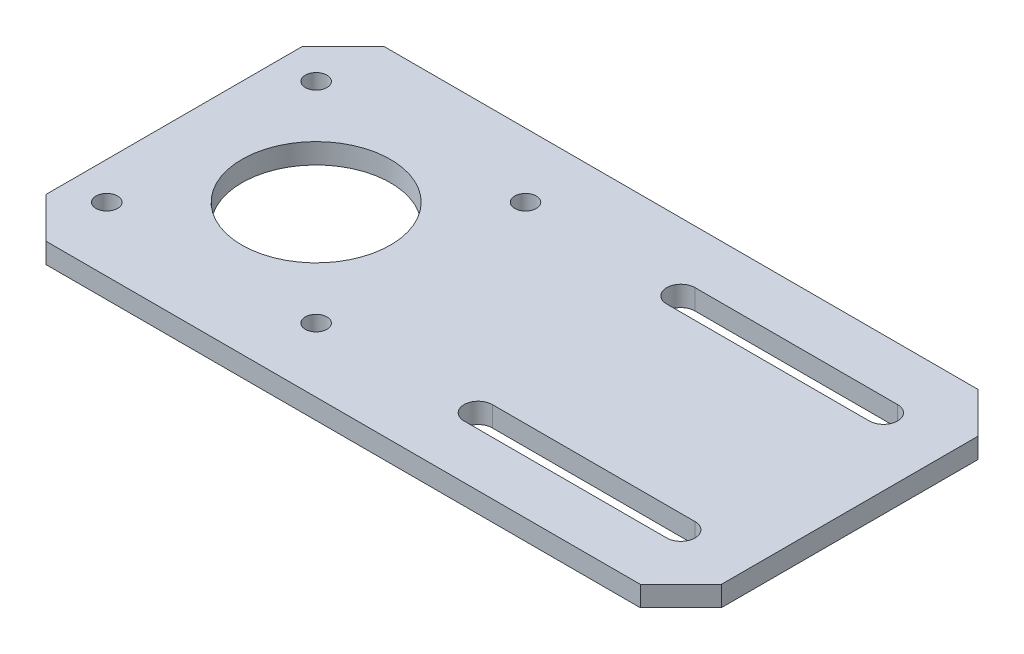
ISO-10303-21;
HEADER;
FILE_DESCRIPTION(('STEP AP214'),'2;1');
FILE_NAME('part.step','',(''),(''),'','','');
FILE_SCHEMA(('AUTOMOTIVE_DESIGN { 1 0 10303 214 1 1 1 1 }'));
ENDSEC;
DATA;
#1=APPLICATION_CONTEXT('core data for automotive mechanical design processes');
#2=APPLICATION_PROTOCOL_DEFINITION('international standard','automotive_design',2000,#1);
#3=PRODUCT_CONTEXT('',#1,'mechanical');
#4=PRODUCT('Part','Part','',(#3));
#5=PRODUCT_RELATED_PRODUCT_CATEGORY('part','',(#4));
#6=PRODUCT_DEFINITION_FORMATION('','',#4);
#7=PRODUCT_DEFINITION_CONTEXT('part definition',#1,'design');
#8=PRODUCT_DEFINITION('design','',#6,#7);
#9=PRODUCT_DEFINITION_SHAPE('','',#8);
#10=(LENGTH_UNIT() NAMED_UNIT(*) SI_UNIT(.MILLI.,.METRE.));
#11=(NAMED_UNIT(*) PLANE_ANGLE_UNIT() SI_UNIT($,.RADIAN.));
#12=(NAMED_UNIT(*) SI_UNIT($,.STERADIAN.) SOLID_ANGLE_UNIT());
#13=UNCERTAINTY_MEASURE_WITH_UNIT(LENGTH_MEASURE(1.E-05),#10,'distance_accuracy_value','');
#14=(GEOMETRIC_REPRESENTATION_CONTEXT(3) GLOBAL_UNCERTAINTY_ASSIGNED_CONTEXT((#13)) GLOBAL_UNIT_ASSIGNED_CONTEXT((#10,
#11,#12)) REPRESENTATION_CONTEXT('',''));
#15=CARTESIAN_POINT('',(0.,0.,0.));
#16=DIRECTION('',(0.,0.,1.));
#17=DIRECTION('',(1.,0.,0.));
#18=AXIS2_PLACEMENT_3D('',#15,#16,#17);
#19=CARTESIAN_POINT('',(0.,3.,0.));
#20=DIRECTION('',(0.,-1.,0.));
#21=DIRECTION('',(0.,0.,-1.));
#22=AXIS2_PLACEMENT_3D('',#19,#20,#21);
#23=PLANE('',#22);
#24=CARTESIAN_POINT('',(60.,3.,-40.));
#25=DIRECTION('',(0.,1.,0.));
#26=DIRECTION('',(0.,0.,1.));
#27=AXIS2_PLACEMENT_3D('',#24,#25,#26);
#28=CIRCLE('',#27,2.09999999999999);
#29=CARTESIAN_POINT('',(60.,3.,-42.1));
#30=VERTEX_POINT('',#29);
#31=CARTESIAN_POINT('',(60.,3.,-37.9));
#32=VERTEX_POINT('',#31);
#33=EDGE_CURVE('E192',#30,#32,#28,.T.);
#34=ORIENTED_EDGE('',*,*,#33,.F.);
#35=DIRECTION('',(-1.,0.,0.));
#36=VECTOR('',#35,1.);
#37=CARTESIAN_POINT('',(60.,3.,-42.1));
#38=LINE('',#37,#36);
#39=CARTESIAN_POINT('',(90.,3.,-42.1));
#40=VERTEX_POINT('',#39);
#41=EDGE_CURVE('E200',#40,#30,#38,.T.);
#42=ORIENTED_EDGE('',*,*,#41,.F.);
#43=CARTESIAN_POINT('',(90.,3.,-40.));
#44=DIRECTION('',(0.,1.,0.));
#45=DIRECTION('',(0.,0.,1.));
#46=AXIS2_PLACEMENT_3D('',#43,#44,#45);
#47=CIRCLE('',#46,2.09999999999999);
#48=CARTESIAN_POINT('',(90.,3.,-37.9));
#49=VERTEX_POINT('',#48);
#50=EDGE_CURVE('E197',#49,#40,#47,.T.);
#51=ORIENTED_EDGE('',*,*,#50,.F.);
#52=DIRECTION('',(1.,0.,0.));
#53=VECTOR('',#52,1.);
#54=CARTESIAN_POINT('',(60.,3.,-37.9));
#55=LINE('',#54,#53);
#56=EDGE_CURVE('E194',#32,#49,#55,.T.);
#57=ORIENTED_EDGE('',*,*,#56,.F.);
#58=EDGE_LOOP('',(#34,#42,#51,#57));
#59=FACE_BOUND('',#58,.T.);
#60=DIRECTION('',(0.,0.,1.));
#61=VECTOR('',#60,1.);
#62=CARTESIAN_POINT('',(0.,3.,0.));
#63=LINE('',#62,#61);
#64=CARTESIAN_POINT('',(0.,3.,-44.));
#65=VERTEX_POINT('',#64);
#66=CARTESIAN_POINT('',(0.,3.,-6.00000000000003));
#67=VERTEX_POINT('',#66);
#68=EDGE_CURVE('E253',#65,#67,#63,.T.);
#69=ORIENTED_EDGE('',*,*,#68,.T.);
#70=DIRECTION('',(-0.707106781186547,0.,-0.707106781186548));
#71=VECTOR('',#70,1.);
#72=CARTESIAN_POINT('',(6.00000000000002,3.,0.));
#73=LINE('',#72,#71);
#74=CARTESIAN_POINT('',(6.00000000000002,3.,0.));
#75=VERTEX_POINT('',#74);
#76=EDGE_CURVE('E296',#67,#75,#73,.F.);
#77=ORIENTED_EDGE('',*,*,#76,.T.);
#78=DIRECTION('',(1.,0.,0.));
#79=VECTOR('',#78,1.);
#80=CARTESIAN_POINT('',(0.,3.,0.));
#81=LINE('',#80,#79);
#82=CARTESIAN_POINT('',(94.,3.,0.));
#83=VERTEX_POINT('',#82);
#84=EDGE_CURVE('E256',#75,#83,#81,.T.);
#85=ORIENTED_EDGE('',*,*,#84,.T.);
#86=DIRECTION('',(-0.707106781186548,0.,0.707106781186547));
#87=VECTOR('',#86,1.);
#88=CARTESIAN_POINT('',(100.,3.,-6.00000000000002));
#89=LINE('',#88,#87);
#90=CARTESIAN_POINT('',(100.,3.,-6.00000000000002));
#91=VERTEX_POINT('',#90);
#92=EDGE_CURVE('E291',#83,#91,#89,.F.);
#93=ORIENTED_EDGE('',*,*,#92,.T.);
#94=DIRECTION('',(0.,0.,-1.));
#95=VECTOR('',#94,1.);
#96=CARTESIAN_POINT('',(100.,3.,0.));
#97=LINE('',#96,#95);
#98=CARTESIAN_POINT('',(100.,3.,-44.));
#99=VERTEX_POINT('',#98);
#100=EDGE_CURVE('E260',#91,#99,#97,.T.);
#101=ORIENTED_EDGE('',*,*,#100,.T.);
#102=DIRECTION('',(0.707106781186545,0.,0.70710678118655));
#103=VECTOR('',#102,1.);
#104=CARTESIAN_POINT('',(94.,3.,-50.));
#105=LINE('',#104,#103);
#106=CARTESIAN_POINT('',(94.,3.,-50.));
#107=VERTEX_POINT('',#106);
#108=EDGE_CURVE('E58',#99,#107,#105,.F.);
#109=ORIENTED_EDGE('',*,*,#108,.T.);
#110=DIRECTION('',(-1.,0.,0.));
#111=VECTOR('',#110,1.);
#112=CARTESIAN_POINT('',(0.,3.,-50.));
#113=LINE('',#112,#111);
#114=CARTESIAN_POINT('',(6.00000000000003,3.,-50.));
#115=VERTEX_POINT('',#114);
#116=EDGE_CURVE('E262',#107,#115,#113,.T.);
#117=ORIENTED_EDGE('',*,*,#116,.T.);
#118=DIRECTION('',(0.707106781186549,0.,-0.707106781186546));
#119=VECTOR('',#118,1.);
#120=CARTESIAN_POINT('',(0.,3.,-44.));
#121=LINE('',#120,#119);
#122=EDGE_CURVE('E294',#115,#65,#121,.F.);
#123=ORIENTED_EDGE('',*,*,#122,.T.);
#124=EDGE_LOOP('',(#69,#77,#85,#93,#101,#109,#117,#123));
#125=FACE_BOUND('',#124,.T.);
#126=CARTESIAN_POINT('',(21.,3.,-25.));
#127=DIRECTION('',(0.,1.,0.));
#128=DIRECTION('',(0.,0.,1.));
#129=AXIS2_PLACEMENT_3D('',#126,#127,#128);
#130=CIRCLE('',#129,11.);
#131=CARTESIAN_POINT('',(21.,3.,-14.));
#132=VERTEX_POINT('',#131);
#133=EDGE_CURVE('E247',#132,#132,#130,.T.);
#134=ORIENTED_EDGE('',*,*,#133,.F.);
#135=EDGE_LOOP('',(#134));
#136=FACE_BOUND('',#135,.T.);
#137=CARTESIAN_POINT('',(5.5,3.,-40.5));
#138=DIRECTION('',(0.,1.,0.));
#139=DIRECTION('',(0.,0.,1.));
#140=AXIS2_PLACEMENT_3D('',#137,#138,#139);
#141=CIRCLE('',#140,1.6);
#142=CARTESIAN_POINT('',(5.5,3.,-38.9));
#143=VERTEX_POINT('',#142);
#144=EDGE_CURVE('E241',#143,#143,#141,.T.);
#145=ORIENTED_EDGE('',*,*,#144,.F.);
#146=EDGE_LOOP('',(#145));
#147=FACE_BOUND('',#146,.T.);
#148=CARTESIAN_POINT('',(36.5,3.,-40.5));
#149=DIRECTION('',(0.,1.,0.));
#150=DIRECTION('',(0.,0.,1.));
#151=AXIS2_PLACEMENT_3D('',#148,#149,#150);
#152=CIRCLE('',#151,1.6);
#153=CARTESIAN_POINT('',(36.5,3.,-38.9));
#154=VERTEX_POINT('',#153);
#155=EDGE_CURVE('E235',#154,#154,#152,.T.);
#156=ORIENTED_EDGE('',*,*,#155,.F.);
#157=EDGE_LOOP('',(#156));
#158=FACE_BOUND('',#157,.T.);
#159=CARTESIAN_POINT('',(36.5,3.,-9.5));
#160=DIRECTION('',(0.,1.,0.));
#161=DIRECTION('',(0.,0.,1.));
#162=AXIS2_PLACEMENT_3D('',#159,#160,#161);
#163=CIRCLE('',#162,1.6);
#164=CARTESIAN_POINT('',(36.5,3.,-7.9));
#165=VERTEX_POINT('',#164);
#166=EDGE_CURVE('E229',#165,#165,#163,.T.);
#167=ORIENTED_EDGE('',*,*,#166,.F.);
#168=EDGE_LOOP('',(#167));
#169=FACE_BOUND('',#168,.T.);
#170=CARTESIAN_POINT('',(5.50000000000001,3.,-9.5));
#171=DIRECTION('',(0.,1.,0.));
#172=DIRECTION('',(0.,0.,1.));
#173=AXIS2_PLACEMENT_3D('',#170,#171,#172);
#174=CIRCLE('',#173,1.6);
#175=CARTESIAN_POINT('',(5.50000000000001,3.,-7.9));
#176=VERTEX_POINT('',#175);
#177=EDGE_CURVE('E223',#176,#176,#174,.T.);
#178=ORIENTED_EDGE('',*,*,#177,.F.);
#179=EDGE_LOOP('',(#178));
#180=FACE_BOUND('',#179,.T.);
#181=CARTESIAN_POINT('',(60.,3.,-10.));
#182=DIRECTION('',(0.,1.,0.));
#183=DIRECTION('',(0.,0.,-1.));
#184=AXIS2_PLACEMENT_3D('',#181,#182,#183);
#185=CIRCLE('',#184,2.09999999999999);
#186=CARTESIAN_POINT('',(60.,3.,-12.1));
#187=VERTEX_POINT('',#186);
#188=CARTESIAN_POINT('',(60.,3.,-7.90000000000001));
#189=VERTEX_POINT('',#188);
#190=EDGE_CURVE('E151',#187,#189,#185,.T.);
#191=ORIENTED_EDGE('',*,*,#190,.F.);
#192=DIRECTION('',(-1.,0.,0.));
#193=VECTOR('',#192,1.);
#194=CARTESIAN_POINT('',(60.,3.,-12.1));
#195=LINE('',#194,#193);
#196=CARTESIAN_POINT('',(90.,3.,-12.1));
#197=VERTEX_POINT('',#196);
#198=EDGE_CURVE('E176',#197,#187,#195,.T.);
#199=ORIENTED_EDGE('',*,*,#198,.F.);
#200=CARTESIAN_POINT('',(90.,3.,-10.));
#201=DIRECTION('',(0.,1.,0.));
#202=DIRECTION('',(0.,0.,-1.));
#203=AXIS2_PLACEMENT_3D('',#200,#201,#202);
#204=CIRCLE('',#203,2.09999999999999);
#205=CARTESIAN_POINT('',(90.,3.,-7.90000000000002));
#206=VERTEX_POINT('',#205);
#207=EDGE_CURVE('E174',#206,#197,#204,.T.);
#208=ORIENTED_EDGE('',*,*,#207,.F.);
#209=DIRECTION('',(1.,0.,0.));
#210=VECTOR('',#209,1.);
#211=CARTESIAN_POINT('',(60.,3.,-7.90000000000001));
#212=LINE('',#211,#210);
#213=EDGE_CURVE('E161',#189,#206,#212,.T.);
#214=ORIENTED_EDGE('',*,*,#213,.F.);
#215=EDGE_LOOP('',(#191,#199,#208,#214));
#216=FACE_BOUND('',#215,.T.);
#217=ADVANCED_FACE('F36',(#59,#125,#136,#147,#158,#169,#180,#216),#23,.F.);
#218=CARTESIAN_POINT('',(0.,0.,0.));
#219=DIRECTION('',(0.,-1.,0.));
#220=DIRECTION('',(0.,0.,-1.));
#221=AXIS2_PLACEMENT_3D('',#218,#219,#220);
#222=PLANE('',#221);
#223=CARTESIAN_POINT('',(36.5,0.,-9.5));
#224=DIRECTION('',(0.,1.,0.));
#225=DIRECTION('',(0.,0.,1.));
#226=AXIS2_PLACEMENT_3D('',#223,#224,#225);
#227=CIRCLE('',#226,1.6);
#228=CARTESIAN_POINT('',(36.5,0.,-7.9));
#229=VERTEX_POINT('',#228);
#230=EDGE_CURVE('E226',#229,#229,#227,.T.);
#231=ORIENTED_EDGE('',*,*,#230,.T.);
#232=EDGE_LOOP('',(#231));
#233=FACE_BOUND('',#232,.T.);
#234=CARTESIAN_POINT('',(5.5,0.,-40.5));
#235=DIRECTION('',(0.,1.,0.));
#236=DIRECTION('',(0.,0.,1.));
#237=AXIS2_PLACEMENT_3D('',#234,#235,#236);
#238=CIRCLE('',#237,1.6);
#239=CARTESIAN_POINT('',(5.5,0.,-38.9));
#240=VERTEX_POINT('',#239);
#241=EDGE_CURVE('E238',#240,#240,#238,.T.);
#242=ORIENTED_EDGE('',*,*,#241,.T.);
#243=EDGE_LOOP('',(#242));
#244=FACE_BOUND('',#243,.T.);
#245=DIRECTION('',(1.,0.,0.));
#246=VECTOR('',#245,1.);
#247=CARTESIAN_POINT('',(0.,0.,0.));
#248=LINE('',#247,#246);
#249=CARTESIAN_POINT('',(6.00000000000002,0.,0.));
#250=VERTEX_POINT('',#249);
#251=CARTESIAN_POINT('',(94.,0.,0.));
#252=VERTEX_POINT('',#251);
#253=EDGE_CURVE('E267',#250,#252,#248,.T.);
#254=ORIENTED_EDGE('',*,*,#253,.F.);
#255=DIRECTION('',(0.707106781186547,0.,0.707106781186548));
#256=VECTOR('',#255,1.);
#257=CARTESIAN_POINT('',(3.00000000000002,0.,-3.00000000000001));
#258=LINE('',#257,#256);
#259=CARTESIAN_POINT('',(0.,0.,-6.00000000000003));
#260=VERTEX_POINT('',#259);
#261=EDGE_CURVE('E284',#250,#260,#258,.F.);
#262=ORIENTED_EDGE('',*,*,#261,.T.);
#263=DIRECTION('',(0.,0.,1.));
#264=VECTOR('',#263,1.);
#265=CARTESIAN_POINT('',(0.,0.,0.));
#266=LINE('',#265,#264);
#267=CARTESIAN_POINT('',(0.,0.,-44.));
#268=VERTEX_POINT('',#267);
#269=EDGE_CURVE('E250',#268,#260,#266,.T.);
#270=ORIENTED_EDGE('',*,*,#269,.F.);
#271=DIRECTION('',(-0.707106781186549,0.,0.707106781186546));
#272=VECTOR('',#271,1.);
#273=CARTESIAN_POINT('',(-22.,0.,-22.0000000000001));
#274=LINE('',#273,#272);
#275=CARTESIAN_POINT('',(6.00000000000003,0.,-50.));
#276=VERTEX_POINT('',#275);
#277=EDGE_CURVE('E282',#268,#276,#274,.F.);
#278=ORIENTED_EDGE('',*,*,#277,.T.);
#279=DIRECTION('',(-1.,0.,0.));
#280=VECTOR('',#279,1.);
#281=CARTESIAN_POINT('',(0.,0.,-50.));
#282=LINE('',#281,#280);
#283=CARTESIAN_POINT('',(94.,0.,-50.));
#284=VERTEX_POINT('',#283);
#285=EDGE_CURVE('E257',#284,#276,#282,.T.);
#286=ORIENTED_EDGE('',*,*,#285,.F.);
#287=DIRECTION('',(-0.707106781186545,0.,-0.70710678118655));
#288=VECTOR('',#287,1.);
#289=CARTESIAN_POINT('',(72.0000000000003,0.,-71.9999999999998));
#290=LINE('',#289,#288);
#291=CARTESIAN_POINT('',(100.,0.,-44.));
#292=VERTEX_POINT('',#291);
#293=EDGE_CURVE('E280',#284,#292,#290,.F.);
#294=ORIENTED_EDGE('',*,*,#293,.T.);
#295=DIRECTION('',(0.,0.,-1.));
#296=VECTOR('',#295,1.);
#297=CARTESIAN_POINT('',(100.,0.,0.));
#298=LINE('',#297,#296);
#299=CARTESIAN_POINT('',(100.,0.,-6.00000000000002));
#300=VERTEX_POINT('',#299);
#301=EDGE_CURVE('E270',#300,#292,#298,.T.);
#302=ORIENTED_EDGE('',*,*,#301,.F.);
#303=DIRECTION('',(0.707106781186548,0.,-0.707106781186547));
#304=VECTOR('',#303,1.);
#305=CARTESIAN_POINT('',(46.9999999999999,0.,47.));
#306=LINE('',#305,#304);
#307=EDGE_CURVE('E278',#300,#252,#306,.F.);
#308=ORIENTED_EDGE('',*,*,#307,.T.);
#309=EDGE_LOOP('',(#254,#262,#270,#278,#286,#294,#302,#308));
#310=FACE_BOUND('',#309,.T.);
#311=CARTESIAN_POINT('',(21.,0.,-25.));
#312=DIRECTION('',(0.,1.,0.));
#313=DIRECTION('',(0.,0.,1.));
#314=AXIS2_PLACEMENT_3D('',#311,#312,#313);
#315=CIRCLE('',#314,11.);
#316=CARTESIAN_POINT('',(21.,0.,-14.));
#317=VERTEX_POINT('',#316);
#318=EDGE_CURVE('E244',#317,#317,#315,.T.);
#319=ORIENTED_EDGE('',*,*,#318,.T.);
#320=EDGE_LOOP('',(#319));
#321=FACE_BOUND('',#320,.T.);
#322=CARTESIAN_POINT('',(36.5,0.,-40.5));
#323=DIRECTION('',(0.,1.,0.));
#324=DIRECTION('',(0.,0.,1.));
#325=AXIS2_PLACEMENT_3D('',#322,#323,#324);
#326=CIRCLE('',#325,1.6);
#327=CARTESIAN_POINT('',(36.5,0.,-38.9));
#328=VERTEX_POINT('',#327);
#329=EDGE_CURVE('E232',#328,#328,#326,.T.);
#330=ORIENTED_EDGE('',*,*,#329,.T.);
#331=EDGE_LOOP('',(#330));
#332=FACE_BOUND('',#331,.T.);
#333=CARTESIAN_POINT('',(5.50000000000001,0.,-9.5));
#334=DIRECTION('',(0.,1.,0.));
#335=DIRECTION('',(0.,0.,1.));
#336=AXIS2_PLACEMENT_3D('',#333,#334,#335);
#337=CIRCLE('',#336,1.6);
#338=CARTESIAN_POINT('',(5.50000000000001,0.,-7.9));
#339=VERTEX_POINT('',#338);
#340=EDGE_CURVE('E222',#339,#339,#337,.T.);
#341=ORIENTED_EDGE('',*,*,#340,.T.);
#342=EDGE_LOOP('',(#341));
#343=FACE_BOUND('',#342,.T.);
#344=DIRECTION('',(-1.,0.,0.));
#345=VECTOR('',#344,1.);
#346=CARTESIAN_POINT('',(60.,0.,-42.1));
#347=LINE('',#346,#345);
#348=CARTESIAN_POINT('',(90.,0.,-42.1));
#349=VERTEX_POINT('',#348);
#350=CARTESIAN_POINT('',(60.,0.,-42.1));
#351=VERTEX_POINT('',#350);
#352=EDGE_CURVE('E195',#349,#351,#347,.T.);
#353=ORIENTED_EDGE('',*,*,#352,.T.);
#354=CARTESIAN_POINT('',(60.,0.,-40.));
#355=DIRECTION('',(0.,1.,0.));
#356=DIRECTION('',(0.,0.,1.));
#357=AXIS2_PLACEMENT_3D('',#354,#355,#356);
#358=CIRCLE('',#357,2.09999999999999);
#359=CARTESIAN_POINT('',(60.,0.,-37.9));
#360=VERTEX_POINT('',#359);
#361=EDGE_CURVE('E169',#351,#360,#358,.T.);
#362=ORIENTED_EDGE('',*,*,#361,.T.);
#363=DIRECTION('',(1.,0.,0.));
#364=VECTOR('',#363,1.);
#365=CARTESIAN_POINT('',(60.,0.,-37.9));
#366=LINE('',#365,#364);
#367=CARTESIAN_POINT('',(90.,0.,-37.9));
#368=VERTEX_POINT('',#367);
#369=EDGE_CURVE('E205',#360,#368,#366,.T.);
#370=ORIENTED_EDGE('',*,*,#369,.T.);
#371=CARTESIAN_POINT('',(90.,0.,-40.));
#372=DIRECTION('',(0.,1.,0.));
#373=DIRECTION('',(0.,0.,1.));
#374=AXIS2_PLACEMENT_3D('',#371,#372,#373);
#375=CIRCLE('',#374,2.09999999999999);
#376=EDGE_CURVE('E208',#368,#349,#375,.T.);
#377=ORIENTED_EDGE('',*,*,#376,.T.);
#378=EDGE_LOOP('',(#353,#362,#370,#377));
#379=FACE_BOUND('',#378,.T.);
#380=DIRECTION('',(-1.,0.,0.));
#381=VECTOR('',#380,1.);
#382=CARTESIAN_POINT('',(60.,0.,-12.1));
#383=LINE('',#382,#381);
#384=CARTESIAN_POINT('',(90.,0.,-12.1));
#385=VERTEX_POINT('',#384);
#386=CARTESIAN_POINT('',(60.,0.,-12.1));
#387=VERTEX_POINT('',#386);
#388=EDGE_CURVE('E162',#385,#387,#383,.T.);
#389=ORIENTED_EDGE('',*,*,#388,.T.);
#390=CARTESIAN_POINT('',(60.,0.,-10.));
#391=DIRECTION('',(0.,1.,0.));
#392=DIRECTION('',(0.,0.,-1.));
#393=AXIS2_PLACEMENT_3D('',#390,#391,#392);
#394=CIRCLE('',#393,2.09999999999999);
#395=CARTESIAN_POINT('',(60.,0.,-7.90000000000001));
#396=VERTEX_POINT('',#395);
#397=EDGE_CURVE('E180',#387,#396,#394,.T.);
#398=ORIENTED_EDGE('',*,*,#397,.T.);
#399=DIRECTION('',(1.,0.,0.));
#400=VECTOR('',#399,1.);
#401=CARTESIAN_POINT('',(60.,0.,-7.90000000000001));
#402=LINE('',#401,#400);
#403=CARTESIAN_POINT('',(90.,0.,-7.90000000000002));
#404=VERTEX_POINT('',#403);
#405=EDGE_CURVE('E168',#396,#404,#402,.T.);
#406=ORIENTED_EDGE('',*,*,#405,.T.);
#407=CARTESIAN_POINT('',(90.,0.,-10.));
#408=DIRECTION('',(0.,1.,0.));
#409=DIRECTION('',(0.,0.,-1.));
#410=AXIS2_PLACEMENT_3D('',#407,#408,#409);
#411=CIRCLE('',#410,2.09999999999999);
#412=EDGE_CURVE('E183',#404,#385,#411,.T.);
#413=ORIENTED_EDGE('',*,*,#412,.T.);
#414=EDGE_LOOP('',(#389,#398,#406,#413));
#415=FACE_BOUND('',#414,.T.);
#416=ADVANCED_FACE('F312',(#233,#244,#310,#321,#332,#343,#379,#415),#222,.T.);
#417=CARTESIAN_POINT('',(0.,3.,0.));
#418=DIRECTION('',(1.,0.,0.));
#419=DIRECTION('',(0.,0.,-1.));
#420=AXIS2_PLACEMENT_3D('',#417,#418,#419);
#421=PLANE('',#420);
#422=ORIENTED_EDGE('',*,*,#269,.T.);
#423=DIRECTION('',(0.,1.,0.));
#424=VECTOR('',#423,1.);
#425=CARTESIAN_POINT('',(0.,3.,-6.00000000000003));
#426=LINE('',#425,#424);
#427=EDGE_CURVE('E289',#260,#67,#426,.T.);
#428=ORIENTED_EDGE('',*,*,#427,.T.);
#429=ORIENTED_EDGE('',*,*,#68,.F.);
#430=DIRECTION('',(0.,-1.,0.));
#431=VECTOR('',#430,1.);
#432=CARTESIAN_POINT('',(0.,3.,-44.));
#433=LINE('',#432,#431);
#434=EDGE_CURVE('E286',#65,#268,#433,.T.);
#435=ORIENTED_EDGE('',*,*,#434,.T.);
#436=EDGE_LOOP('',(#422,#428,#429,#435));
#437=FACE_BOUND('',#436,.T.);
#438=ADVANCED_FACE('F327',(#437),#421,.F.);
#439=CARTESIAN_POINT('',(0.,3.,0.));
#440=DIRECTION('',(0.,0.,-1.));
#441=DIRECTION('',(-1.,0.,0.));
#442=AXIS2_PLACEMENT_3D('',#439,#440,#441);
#443=PLANE('',#442);
#444=ORIENTED_EDGE('',*,*,#84,.F.);
#445=DIRECTION('',(0.,-1.,0.));
#446=VECTOR('',#445,1.);
#447=CARTESIAN_POINT('',(6.00000000000002,3.,0.));
#448=LINE('',#447,#446);
#449=EDGE_CURVE('E275',#75,#250,#448,.T.);
#450=ORIENTED_EDGE('',*,*,#449,.T.);
#451=ORIENTED_EDGE('',*,*,#253,.T.);
#452=DIRECTION('',(0.,1.,0.));
#453=VECTOR('',#452,1.);
#454=CARTESIAN_POINT('',(94.,3.,0.));
#455=LINE('',#454,#453);
#456=EDGE_CURVE('E264',#252,#83,#455,.T.);
#457=ORIENTED_EDGE('',*,*,#456,.T.);
#458=EDGE_LOOP('',(#444,#450,#451,#457));
#459=FACE_BOUND('',#458,.T.);
#460=ADVANCED_FACE('F335',(#459),#443,.F.);
#461=CARTESIAN_POINT('',(100.,3.,0.));
#462=DIRECTION('',(-1.,0.,0.));
#463=DIRECTION('',(0.,0.,1.));
#464=AXIS2_PLACEMENT_3D('',#461,#462,#463);
#465=PLANE('',#464);
#466=ORIENTED_EDGE('',*,*,#301,.T.);
#467=DIRECTION('',(0.,1.,0.));
#468=VECTOR('',#467,1.);
#469=CARTESIAN_POINT('',(100.,3.,-44.));
#470=LINE('',#469,#468);
#471=EDGE_CURVE('E11',#292,#99,#470,.T.);
#472=ORIENTED_EDGE('',*,*,#471,.T.);
#473=ORIENTED_EDGE('',*,*,#100,.F.);
#474=DIRECTION('',(0.,-1.,0.));
#475=VECTOR('',#474,1.);
#476=CARTESIAN_POINT('',(100.,3.,-6.00000000000002));
#477=LINE('',#476,#475);
#478=EDGE_CURVE('E44',#91,#300,#477,.T.);
#479=ORIENTED_EDGE('',*,*,#478,.T.);
#480=EDGE_LOOP('',(#466,#472,#473,#479));
#481=FACE_BOUND('',#480,.T.);
#482=ADVANCED_FACE('F306',(#481),#465,.F.);
#483=CARTESIAN_POINT('',(0.,3.,-50.));
#484=DIRECTION('',(0.,0.,1.));
#485=DIRECTION('',(1.,0.,0.));
#486=AXIS2_PLACEMENT_3D('',#483,#484,#485);
#487=PLANE('',#486);
#488=ORIENTED_EDGE('',*,*,#285,.T.);
#489=DIRECTION('',(0.,1.,0.));
#490=VECTOR('',#489,1.);
#491=CARTESIAN_POINT('',(6.00000000000003,3.,-50.));
#492=LINE('',#491,#490);
#493=EDGE_CURVE('E51',#276,#115,#492,.T.);
#494=ORIENTED_EDGE('',*,*,#493,.T.);
#495=ORIENTED_EDGE('',*,*,#116,.F.);
#496=DIRECTION('',(0.,-1.,0.));
#497=VECTOR('',#496,1.);
#498=CARTESIAN_POINT('',(94.,3.,-50.));
#499=LINE('',#498,#497);
#500=EDGE_CURVE('E298',#107,#284,#499,.T.);
#501=ORIENTED_EDGE('',*,*,#500,.T.);
#502=EDGE_LOOP('',(#488,#494,#495,#501));
#503=FACE_BOUND('',#502,.T.);
#504=ADVANCED_FACE('F318',(#503),#487,.F.);
#505=CARTESIAN_POINT('',(21.,3.,-25.));
#506=DIRECTION('',(0.,-1.,0.));
#507=DIRECTION('',(0.,0.,-1.));
#508=AXIS2_PLACEMENT_3D('',#505,#506,#507);
#509=CYLINDRICAL_SURFACE('',#508,11.);
#510=ORIENTED_EDGE('',*,*,#133,.T.);
#511=EDGE_LOOP('',(#510));
#512=FACE_BOUND('',#511,.T.);
#513=ORIENTED_EDGE('',*,*,#318,.F.);
#514=EDGE_LOOP('',(#513));
#515=FACE_BOUND('',#514,.T.);
#516=ADVANCED_FACE('F351',(#512,#515),#509,.F.);
#517=CARTESIAN_POINT('',(5.5,3.,-40.5));
#518=DIRECTION('',(0.,-1.,0.));
#519=DIRECTION('',(0.,0.,-1.));
#520=AXIS2_PLACEMENT_3D('',#517,#518,#519);
#521=CYLINDRICAL_SURFACE('',#520,1.6);
#522=ORIENTED_EDGE('',*,*,#144,.T.);
#523=EDGE_LOOP('',(#522));
#524=FACE_BOUND('',#523,.T.);
#525=ORIENTED_EDGE('',*,*,#241,.F.);
#526=EDGE_LOOP('',(#525));
#527=FACE_BOUND('',#526,.T.);
#528=ADVANCED_FACE('F481',(#524,#527),#521,.F.);
#529=CARTESIAN_POINT('',(36.5,3.,-40.5));
#530=DIRECTION('',(0.,-1.,0.));
#531=DIRECTION('',(0.,0.,-1.));
#532=AXIS2_PLACEMENT_3D('',#529,#530,#531);
#533=CYLINDRICAL_SURFACE('',#532,1.6);
#534=ORIENTED_EDGE('',*,*,#155,.T.);
#535=EDGE_LOOP('',(#534));
#536=FACE_BOUND('',#535,.T.);
#537=ORIENTED_EDGE('',*,*,#329,.F.);
#538=EDGE_LOOP('',(#537));
#539=FACE_BOUND('',#538,.T.);
#540=ADVANCED_FACE('F472',(#536,#539),#533,.F.);
#541=CARTESIAN_POINT('',(36.5,3.,-9.5));
#542=DIRECTION('',(0.,-1.,0.));
#543=DIRECTION('',(0.,0.,-1.));
#544=AXIS2_PLACEMENT_3D('',#541,#542,#543);
#545=CYLINDRICAL_SURFACE('',#544,1.6);
#546=ORIENTED_EDGE('',*,*,#166,.T.);
#547=EDGE_LOOP('',(#546));
#548=FACE_BOUND('',#547,.T.);
#549=ORIENTED_EDGE('',*,*,#230,.F.);
#550=EDGE_LOOP('',(#549));
#551=FACE_BOUND('',#550,.T.);
#552=ADVANCED_FACE('F463',(#548,#551),#545,.F.);
#553=CARTESIAN_POINT('',(5.50000000000001,3.,-9.5));
#554=DIRECTION('',(0.,-1.,0.));
#555=DIRECTION('',(0.,0.,-1.));
#556=AXIS2_PLACEMENT_3D('',#553,#554,#555);
#557=CYLINDRICAL_SURFACE('',#556,1.6);
#558=ORIENTED_EDGE('',*,*,#177,.T.);
#559=EDGE_LOOP('',(#558));
#560=FACE_BOUND('',#559,.T.);
#561=ORIENTED_EDGE('',*,*,#340,.F.);
#562=EDGE_LOOP('',(#561));
#563=FACE_BOUND('',#562,.T.);
#564=ADVANCED_FACE('F454',(#560,#563),#557,.F.);
#565=CARTESIAN_POINT('',(60.,3.,-40.));
#566=DIRECTION('',(0.,-1.,0.));
#567=DIRECTION('',(0.,0.,-1.));
#568=AXIS2_PLACEMENT_3D('',#565,#566,#567);
#569=CYLINDRICAL_SURFACE('',#568,2.09999999999999);
#570=ORIENTED_EDGE('',*,*,#361,.F.);
#571=DIRECTION('',(0.,-1.,0.));
#572=VECTOR('',#571,1.);
#573=CARTESIAN_POINT('',(60.,3.,-42.1));
#574=LINE('',#573,#572);
#575=EDGE_CURVE('E202',#30,#351,#574,.T.);
#576=ORIENTED_EDGE('',*,*,#575,.F.);
#577=ORIENTED_EDGE('',*,*,#33,.T.);
#578=DIRECTION('',(0.,-1.,0.));
#579=VECTOR('',#578,1.);
#580=CARTESIAN_POINT('',(60.,3.,-37.9));
#581=LINE('',#580,#579);
#582=EDGE_CURVE('E219',#32,#360,#581,.T.);
#583=ORIENTED_EDGE('',*,*,#582,.T.);
#584=EDGE_LOOP('',(#570,#576,#577,#583));
#585=FACE_BOUND('',#584,.T.);
#586=ADVANCED_FACE('F445',(#585),#569,.F.);
#587=CARTESIAN_POINT('',(60.,3.,-37.9));
#588=DIRECTION('',(0.,0.,-1.));
#589=DIRECTION('',(-1.,0.,0.));
#590=AXIS2_PLACEMENT_3D('',#587,#588,#589);
#591=PLANE('',#590);
#592=ORIENTED_EDGE('',*,*,#369,.F.);
#593=ORIENTED_EDGE('',*,*,#582,.F.);
#594=ORIENTED_EDGE('',*,*,#56,.T.);
#595=DIRECTION('',(0.,-1.,0.));
#596=VECTOR('',#595,1.);
#597=CARTESIAN_POINT('',(90.,3.,-37.9));
#598=LINE('',#597,#596);
#599=EDGE_CURVE('E217',#49,#368,#598,.T.);
#600=ORIENTED_EDGE('',*,*,#599,.T.);
#601=EDGE_LOOP('',(#592,#593,#594,#600));
#602=FACE_BOUND('',#601,.T.);
#603=ADVANCED_FACE('F436',(#602),#591,.T.);
#604=CARTESIAN_POINT('',(90.,3.,-40.));
#605=DIRECTION('',(0.,-1.,0.));
#606=DIRECTION('',(0.,0.,-1.));
#607=AXIS2_PLACEMENT_3D('',#604,#605,#606);
#608=CYLINDRICAL_SURFACE('',#607,2.09999999999999);
#609=ORIENTED_EDGE('',*,*,#376,.F.);
#610=ORIENTED_EDGE('',*,*,#599,.F.);
#611=ORIENTED_EDGE('',*,*,#50,.T.);
#612=DIRECTION('',(0.,-1.,0.));
#613=VECTOR('',#612,1.);
#614=CARTESIAN_POINT('',(90.,3.,-42.1));
#615=LINE('',#614,#613);
#616=EDGE_CURVE('E215',#40,#349,#615,.T.);
#617=ORIENTED_EDGE('',*,*,#616,.T.);
#618=EDGE_LOOP('',(#609,#610,#611,#617));
#619=FACE_BOUND('',#618,.T.);
#620=ADVANCED_FACE('F427',(#619),#608,.F.);
#621=CARTESIAN_POINT('',(60.,3.,-42.1));
#622=DIRECTION('',(0.,0.,1.));
#623=DIRECTION('',(1.,0.,0.));
#624=AXIS2_PLACEMENT_3D('',#621,#622,#623);
#625=PLANE('',#624);
#626=ORIENTED_EDGE('',*,*,#352,.F.);
#627=ORIENTED_EDGE('',*,*,#616,.F.);
#628=ORIENTED_EDGE('',*,*,#41,.T.);
#629=ORIENTED_EDGE('',*,*,#575,.T.);
#630=EDGE_LOOP('',(#626,#627,#628,#629));
#631=FACE_BOUND('',#630,.T.);
#632=ADVANCED_FACE('F419',(#631),#625,.T.);
#633=CARTESIAN_POINT('',(60.,3.,-10.));
#634=DIRECTION('',(0.,-1.,0.));
#635=DIRECTION('',(0.,0.,-1.));
#636=AXIS2_PLACEMENT_3D('',#633,#634,#635);
#637=CYLINDRICAL_SURFACE('',#636,2.09999999999999);
#638=ORIENTED_EDGE('',*,*,#397,.F.);
#639=DIRECTION('',(0.,-1.,0.));
#640=VECTOR('',#639,1.);
#641=CARTESIAN_POINT('',(60.,3.,-12.1));
#642=LINE('',#641,#640);
#643=EDGE_CURVE('E157',#187,#387,#642,.T.);
#644=ORIENTED_EDGE('',*,*,#643,.F.);
#645=ORIENTED_EDGE('',*,*,#190,.T.);
#646=DIRECTION('',(0.,-1.,0.));
#647=VECTOR('',#646,1.);
#648=CARTESIAN_POINT('',(60.,3.,-7.90000000000001));
#649=LINE('',#648,#647);
#650=EDGE_CURVE('E154',#189,#396,#649,.T.);
#651=ORIENTED_EDGE('',*,*,#650,.T.);
#652=EDGE_LOOP('',(#638,#644,#645,#651));
#653=FACE_BOUND('',#652,.T.);
#654=ADVANCED_FACE('F153',(#653),#637,.F.);
#655=CARTESIAN_POINT('',(60.,3.,-7.90000000000001));
#656=DIRECTION('',(0.,0.,-1.));
#657=DIRECTION('',(-1.,0.,0.));
#658=AXIS2_PLACEMENT_3D('',#655,#656,#657);
#659=PLANE('',#658);
#660=ORIENTED_EDGE('',*,*,#405,.F.);
#661=ORIENTED_EDGE('',*,*,#650,.F.);
#662=ORIENTED_EDGE('',*,*,#213,.T.);
#663=DIRECTION('',(0.,-1.,0.));
#664=VECTOR('',#663,1.);
#665=CARTESIAN_POINT('',(90.,3.,-7.90000000000002));
#666=LINE('',#665,#664);
#667=EDGE_CURVE('E170',#206,#404,#666,.T.);
#668=ORIENTED_EDGE('',*,*,#667,.T.);
#669=EDGE_LOOP('',(#660,#661,#662,#668));
#670=FACE_BOUND('',#669,.T.);
#671=ADVANCED_FACE('F165',(#670),#659,.T.);
#672=CARTESIAN_POINT('',(90.,3.,-10.));
#673=DIRECTION('',(0.,-1.,0.));
#674=DIRECTION('',(0.,0.,-1.));
#675=AXIS2_PLACEMENT_3D('',#672,#673,#674);
#676=CYLINDRICAL_SURFACE('',#675,2.09999999999999);
#677=ORIENTED_EDGE('',*,*,#412,.F.);
#678=ORIENTED_EDGE('',*,*,#667,.F.);
#679=ORIENTED_EDGE('',*,*,#207,.T.);
#680=DIRECTION('',(0.,-1.,0.));
#681=VECTOR('',#680,1.);
#682=CARTESIAN_POINT('',(90.,3.,-12.1));
#683=LINE('',#682,#681);
#684=EDGE_CURVE('E189',#197,#385,#683,.T.);
#685=ORIENTED_EDGE('',*,*,#684,.T.);
#686=EDGE_LOOP('',(#677,#678,#679,#685));
#687=FACE_BOUND('',#686,.T.);
#688=ADVANCED_FACE('F395',(#687),#676,.F.);
#689=CARTESIAN_POINT('',(60.,3.,-12.1));
#690=DIRECTION('',(0.,0.,1.));
#691=DIRECTION('',(1.,0.,0.));
#692=AXIS2_PLACEMENT_3D('',#689,#690,#691);
#693=PLANE('',#692);
#694=ORIENTED_EDGE('',*,*,#388,.F.);
#695=ORIENTED_EDGE('',*,*,#684,.F.);
#696=ORIENTED_EDGE('',*,*,#198,.T.);
#697=ORIENTED_EDGE('',*,*,#643,.T.);
#698=EDGE_LOOP('',(#694,#695,#696,#697));
#699=FACE_BOUND('',#698,.T.);
#700=ADVANCED_FACE('F364',(#699),#693,.T.);
#701=CARTESIAN_POINT('',(6.00000000000002,3.,0.));
#702=DIRECTION('',(0.707106781186548,0.,-0.707106781186547));
#703=DIRECTION('',(0.,-1.,0.));
#704=AXIS2_PLACEMENT_3D('',#701,#702,#703);
#705=PLANE('',#704);
#706=ORIENTED_EDGE('',*,*,#76,.F.);
#707=ORIENTED_EDGE('',*,*,#427,.F.);
#708=ORIENTED_EDGE('',*,*,#261,.F.);
#709=ORIENTED_EDGE('',*,*,#449,.F.);
#710=EDGE_LOOP('',(#706,#707,#708,#709));
#711=FACE_BOUND('',#710,.T.);
#712=ADVANCED_FACE('F332',(#711),#705,.F.);
#713=CARTESIAN_POINT('',(0.,3.,-44.));
#714=DIRECTION('',(0.707106781186546,0.,0.707106781186549));
#715=DIRECTION('',(0.,-1.,0.));
#716=AXIS2_PLACEMENT_3D('',#713,#714,#715);
#717=PLANE('',#716);
#718=ORIENTED_EDGE('',*,*,#122,.F.);
#719=ORIENTED_EDGE('',*,*,#493,.F.);
#720=ORIENTED_EDGE('',*,*,#277,.F.);
#721=ORIENTED_EDGE('',*,*,#434,.F.);
#722=EDGE_LOOP('',(#718,#719,#720,#721));
#723=FACE_BOUND('',#722,.T.);
#724=ADVANCED_FACE('F324',(#723),#717,.F.);
#725=CARTESIAN_POINT('',(94.,3.,-50.));
#726=DIRECTION('',(-0.70710678118655,0.,0.707106781186545));
#727=DIRECTION('',(0.,-1.,0.));
#728=AXIS2_PLACEMENT_3D('',#725,#726,#727);
#729=PLANE('',#728);
#730=ORIENTED_EDGE('',*,*,#108,.F.);
#731=ORIENTED_EDGE('',*,*,#471,.F.);
#732=ORIENTED_EDGE('',*,*,#293,.F.);
#733=ORIENTED_EDGE('',*,*,#500,.F.);
#734=EDGE_LOOP('',(#730,#731,#732,#733));
#735=FACE_BOUND('',#734,.T.);
#736=ADVANCED_FACE('F317',(#735),#729,.F.);
#737=CARTESIAN_POINT('',(100.,3.,-6.00000000000002));
#738=DIRECTION('',(-0.707106781186547,0.,-0.707106781186548));
#739=DIRECTION('',(0.,-1.,0.));
#740=AXIS2_PLACEMENT_3D('',#737,#738,#739);
#741=PLANE('',#740);
#742=ORIENTED_EDGE('',*,*,#92,.F.);
#743=ORIENTED_EDGE('',*,*,#456,.F.);
#744=ORIENTED_EDGE('',*,*,#307,.F.);
#745=ORIENTED_EDGE('',*,*,#478,.F.);
#746=EDGE_LOOP('',(#742,#743,#744,#745));
#747=FACE_BOUND('',#746,.T.);
#748=ADVANCED_FACE('F38',(#747),#741,.F.);
#749=CLOSED_SHELL('',(#217,#416,#438,#460,#482,#504,#516,#528,#540,#552,#564,#586,#603,#620,
#632,#654,#671,#688,#700,#712,#724,#736,#748));
#750=MANIFOLD_SOLID_BREP('B2',#749);
#751=ADVANCED_BREP_SHAPE_REPRESENTATION('',(#18,#750),#14);
#752=SHAPE_DEFINITION_REPRESENTATION(#9,#751);
ENDSEC;
END-ISO-10303-21;
